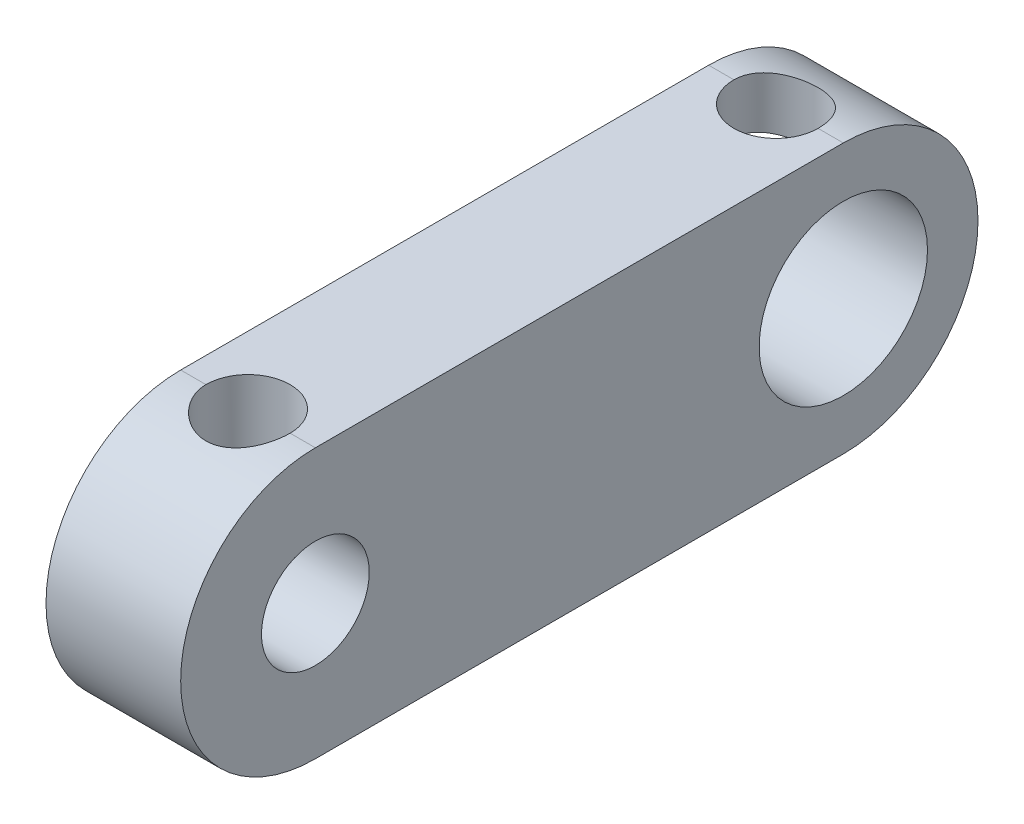
ISO-10303-21;
HEADER;
FILE_DESCRIPTION(('STEP AP214'),'2;1');
FILE_NAME('part.step','',(''),(''),'','','');
FILE_SCHEMA(('AUTOMOTIVE_DESIGN { 1 0 10303 214 1 1 1 1 }'));
ENDSEC;
DATA;
#1=APPLICATION_CONTEXT('core data for automotive mechanical design processes');
#2=APPLICATION_PROTOCOL_DEFINITION('international standard','automotive_design',2000,#1);
#3=PRODUCT_CONTEXT('',#1,'mechanical');
#4=PRODUCT('Part','Part','',(#3));
#5=PRODUCT_RELATED_PRODUCT_CATEGORY('part','',(#4));
#6=PRODUCT_DEFINITION_FORMATION('','',#4);
#7=PRODUCT_DEFINITION_CONTEXT('part definition',#1,'design');
#8=PRODUCT_DEFINITION('design','',#6,#7);
#9=PRODUCT_DEFINITION_SHAPE('','',#8);
#10=(LENGTH_UNIT() NAMED_UNIT(*) SI_UNIT(.MILLI.,.METRE.));
#11=(NAMED_UNIT(*) PLANE_ANGLE_UNIT() SI_UNIT($,.RADIAN.));
#12=(NAMED_UNIT(*) SI_UNIT($,.STERADIAN.) SOLID_ANGLE_UNIT());
#13=UNCERTAINTY_MEASURE_WITH_UNIT(LENGTH_MEASURE(1.E-05),#10,'distance_accuracy_value','');
#14=(GEOMETRIC_REPRESENTATION_CONTEXT(3) GLOBAL_UNCERTAINTY_ASSIGNED_CONTEXT((#13)) GLOBAL_UNIT_ASSIGNED_CONTEXT((#10,
#11,#12)) REPRESENTATION_CONTEXT('',''));
#15=CARTESIAN_POINT('',(0.,0.,0.));
#16=DIRECTION('',(0.,0.,1.));
#17=DIRECTION('',(1.,0.,0.));
#18=AXIS2_PLACEMENT_3D('',#15,#16,#17);
#19=CARTESIAN_POINT('',(2.,0.,0.));
#20=DIRECTION('',(1.,0.,0.));
#21=DIRECTION('',(0.,0.,-1.));
#22=AXIS2_PLACEMENT_3D('',#19,#20,#21);
#23=PLANE('',#22);
#24=CARTESIAN_POINT('',(2.,0.,0.));
#25=DIRECTION('',(1.,0.,0.));
#26=DIRECTION('',(0.,0.,-1.));
#27=AXIS2_PLACEMENT_3D('',#24,#25,#26);
#28=CIRCLE('',#27,1.6);
#29=CARTESIAN_POINT('',(2.,0.,-1.6));
#30=VERTEX_POINT('',#29);
#31=EDGE_CURVE('E229',#30,#30,#28,.T.);
#32=ORIENTED_EDGE('',*,*,#31,.F.);
#33=EDGE_LOOP('',(#32));
#34=FACE_BOUND('',#33,.T.);
#35=CARTESIAN_POINT('',(2.,0.,0.));
#36=DIRECTION('',(1.,0.,0.));
#37=DIRECTION('',(0.,0.,-1.));
#38=AXIS2_PLACEMENT_3D('',#35,#36,#37);
#39=CIRCLE('',#38,4.);
#40=CARTESIAN_POINT('',(2.,4.,0.));
#41=VERTEX_POINT('',#40);
#42=CARTESIAN_POINT('',(2.,-4.,0.));
#43=VERTEX_POINT('',#42);
#44=EDGE_CURVE('E242',#41,#43,#39,.T.);
#45=ORIENTED_EDGE('',*,*,#44,.T.);
#46=DIRECTION('',(0.,0.,-1.));
#47=VECTOR('',#46,1.);
#48=CARTESIAN_POINT('',(2.,-4.,0.));
#49=LINE('',#48,#47);
#50=CARTESIAN_POINT('',(2.,-4.,-15.68));
#51=VERTEX_POINT('',#50);
#52=EDGE_CURVE('E245',#43,#51,#49,.T.);
#53=ORIENTED_EDGE('',*,*,#52,.T.);
#54=CARTESIAN_POINT('',(2.,0.,-15.68));
#55=DIRECTION('',(1.,0.,0.));
#56=DIRECTION('',(0.,0.,-1.));
#57=AXIS2_PLACEMENT_3D('',#54,#55,#56);
#58=CIRCLE('',#57,4.);
#59=CARTESIAN_POINT('',(2.,4.,-15.68));
#60=VERTEX_POINT('',#59);
#61=EDGE_CURVE('E248',#51,#60,#58,.T.);
#62=ORIENTED_EDGE('',*,*,#61,.T.);
#63=DIRECTION('',(0.,0.,1.));
#64=VECTOR('',#63,1.);
#65=CARTESIAN_POINT('',(2.,4.,0.));
#66=LINE('',#65,#64);
#67=EDGE_CURVE('E250',#60,#41,#66,.T.);
#68=ORIENTED_EDGE('',*,*,#67,.T.);
#69=EDGE_LOOP('',(#45,#53,#62,#68));
#70=FACE_BOUND('',#69,.T.);
#71=CARTESIAN_POINT('',(2.,0.,-15.68));
#72=DIRECTION('',(1.,0.,0.));
#73=DIRECTION('',(0.,0.,-1.));
#74=AXIS2_PLACEMENT_3D('',#71,#72,#73);
#75=CIRCLE('',#74,2.5);
#76=CARTESIAN_POINT('',(2.,0.,-18.18));
#77=VERTEX_POINT('',#76);
#78=EDGE_CURVE('E234',#77,#77,#75,.T.);
#79=ORIENTED_EDGE('',*,*,#78,.F.);
#80=EDGE_LOOP('',(#79));
#81=FACE_BOUND('',#80,.T.);
#82=ADVANCED_FACE('F38',(#34,#70,#81),#23,.T.);
#83=CARTESIAN_POINT('',(-2.,0.,0.));
#84=DIRECTION('',(1.,0.,0.));
#85=DIRECTION('',(0.,0.,-1.));
#86=AXIS2_PLACEMENT_3D('',#83,#84,#85);
#87=PLANE('',#86);
#88=CARTESIAN_POINT('',(-2.,0.,0.));
#89=DIRECTION('',(1.,0.,0.));
#90=DIRECTION('',(0.,0.,-1.));
#91=AXIS2_PLACEMENT_3D('',#88,#89,#90);
#92=CIRCLE('',#91,4.);
#93=CARTESIAN_POINT('',(-2.,4.,0.));
#94=VERTEX_POINT('',#93);
#95=CARTESIAN_POINT('',(-2.,-4.,0.));
#96=VERTEX_POINT('',#95);
#97=EDGE_CURVE('E236',#94,#96,#92,.T.);
#98=ORIENTED_EDGE('',*,*,#97,.F.);
#99=DIRECTION('',(0.,0.,1.));
#100=VECTOR('',#99,1.);
#101=CARTESIAN_POINT('',(-2.,4.,0.));
#102=LINE('',#101,#100);
#103=CARTESIAN_POINT('',(-2.,4.,-15.68));
#104=VERTEX_POINT('',#103);
#105=EDGE_CURVE('E246',#104,#94,#102,.T.);
#106=ORIENTED_EDGE('',*,*,#105,.F.);
#107=CARTESIAN_POINT('',(-2.,0.,-15.68));
#108=DIRECTION('',(1.,0.,0.));
#109=DIRECTION('',(0.,0.,-1.));
#110=AXIS2_PLACEMENT_3D('',#107,#108,#109);
#111=CIRCLE('',#110,4.);
#112=CARTESIAN_POINT('',(-2.,-4.,-15.68));
#113=VERTEX_POINT('',#112);
#114=EDGE_CURVE('E127',#113,#104,#111,.T.);
#115=ORIENTED_EDGE('',*,*,#114,.F.);
#116=DIRECTION('',(0.,0.,-1.));
#117=VECTOR('',#116,1.);
#118=CARTESIAN_POINT('',(-2.,-4.,0.));
#119=LINE('',#118,#117);
#120=EDGE_CURVE('E254',#96,#113,#119,.T.);
#121=ORIENTED_EDGE('',*,*,#120,.F.);
#122=EDGE_LOOP('',(#98,#106,#115,#121));
#123=FACE_BOUND('',#122,.T.);
#124=CARTESIAN_POINT('',(-2.,0.,0.));
#125=DIRECTION('',(1.,0.,0.));
#126=DIRECTION('',(0.,0.,-1.));
#127=AXIS2_PLACEMENT_3D('',#124,#125,#126);
#128=CIRCLE('',#127,1.6);
#129=CARTESIAN_POINT('',(-2.,0.,-1.6));
#130=VERTEX_POINT('',#129);
#131=EDGE_CURVE('E232',#130,#130,#128,.T.);
#132=ORIENTED_EDGE('',*,*,#131,.T.);
#133=EDGE_LOOP('',(#132));
#134=FACE_BOUND('',#133,.T.);
#135=CARTESIAN_POINT('',(-2.,0.,-15.68));
#136=DIRECTION('',(1.,0.,0.));
#137=DIRECTION('',(0.,0.,-1.));
#138=AXIS2_PLACEMENT_3D('',#135,#136,#137);
#139=CIRCLE('',#138,2.5);
#140=CARTESIAN_POINT('',(-2.,0.,-18.18));
#141=VERTEX_POINT('',#140);
#142=EDGE_CURVE('E213',#141,#141,#139,.T.);
#143=ORIENTED_EDGE('',*,*,#142,.T.);
#144=EDGE_LOOP('',(#143));
#145=FACE_BOUND('',#144,.T.);
#146=ADVANCED_FACE('F177',(#123,#134,#145),#87,.F.);
#147=CARTESIAN_POINT('',(2.,0.,0.));
#148=DIRECTION('',(-1.,0.,0.));
#149=DIRECTION('',(0.,0.,1.));
#150=AXIS2_PLACEMENT_3D('',#147,#148,#149);
#151=CYLINDRICAL_SURFACE('',#150,4.);
#152=DIRECTION('',(-1.,0.,0.));
#153=VECTOR('',#152,1.);
#154=CARTESIAN_POINT('',(2.,4.,0.));
#155=LINE('',#154,#153);
#156=CARTESIAN_POINT('',(1.25,4.,0.));
#157=VERTEX_POINT('',#156);
#158=EDGE_CURVE('E129',#41,#157,#155,.T.);
#159=ORIENTED_EDGE('',*,*,#158,.T.);
#160=CARTESIAN_POINT('',(1.25,4.,0.));
#161=CARTESIAN_POINT('',(1.25000068192499,4.00000239382464,0.0342840832884206));
#162=CARTESIAN_POINT('',(1.24858860908133,3.99955869763625,0.0685509783801256));
#163=CARTESIAN_POINT('',(1.24296130286244,3.9978046781995,0.136824375647934));
#164=CARTESIAN_POINT('',(1.23874665761304,3.99649453677683,0.170830930942722));
#165=CARTESIAN_POINT('',(1.2219693556147,3.99131416663133,0.271914618020071));
#166=CARTESIAN_POINT('',(1.20527297582088,3.98619364507056,0.33829035451183));
#167=CARTESIAN_POINT('',(1.16143304559352,3.97315917968117,0.467130407420714));
#168=CARTESIAN_POINT('',(1.13429248474057,3.96524603527681,0.529595837194757));
#169=CARTESIAN_POINT('',(1.07039296819695,3.94744238052684,0.6491161948871));
#170=CARTESIAN_POINT('',(1.03362985816415,3.93755101656091,0.706168771384526));
#171=CARTESIAN_POINT('',(0.950345055834868,3.91650242325584,0.814964717697418));
#172=CARTESIAN_POINT('',(0.903581542699087,3.90531774539476,0.86651755791079));
#173=CARTESIAN_POINT('',(0.802134475826564,3.88310103758903,0.961194909805261));
#174=CARTESIAN_POINT('',(0.747449039771977,3.87206904460806,1.00431741262716));
#175=CARTESIAN_POINT('',(0.630054085351311,3.85111120735624,1.0819443164627));
#176=CARTESIAN_POINT('',(0.567179669932036,3.84121943571492,1.11620940995108));
#177=CARTESIAN_POINT('',(0.436204600363461,3.82407768823164,1.17359844406015));
#178=CARTESIAN_POINT('',(0.368105565983853,3.81682689759064,1.19672582161476));
#179=CARTESIAN_POINT('',(0.230772645750465,3.80607612660365,1.23048442546022));
#180=CARTESIAN_POINT('',(0.161634633972238,3.80246980562102,1.24147086756598));
#181=CARTESIAN_POINT('',(0.0224083780122229,3.79910054711683,1.25174556328349));
#182=CARTESIAN_POINT('',(-0.0476796295657095,3.79933666956116,1.25103667809654));
#183=CARTESIAN_POINT('',(-0.183874843206954,3.80353190243403,1.23821821284855));
#184=CARTESIAN_POINT('',(-0.250029884057162,3.80734346144293,1.2265604489678));
#185=CARTESIAN_POINT('',(-0.37939288112431,3.8180203348786,1.19290787753143));
#186=CARTESIAN_POINT('',(-0.442600557163965,3.82488593897253,1.17091208943353));
#187=CARTESIAN_POINT('',(-0.565352271495894,3.84101048347367,1.11688861830883));
#188=CARTESIAN_POINT('',(-0.62482923955642,3.85030294600315,1.08471897460912));
#189=CARTESIAN_POINT('',(-0.737688342405162,3.87021867886758,1.01135970711791));
#190=CARTESIAN_POINT('',(-0.791068953585629,3.880842280497,0.970167835954794));
#191=CARTESIAN_POINT('',(-0.892770211080585,3.90281426048342,0.877721477222062));
#192=CARTESIAN_POINT('',(-0.940750784390827,3.9141736388921,0.826094842820519));
#193=CARTESIAN_POINT('',(-1.02746489236453,3.93591380959217,0.715374277659185));
#194=CARTESIAN_POINT('',(-1.06619606247265,3.94629435124016,0.656278443334608));
#195=CARTESIAN_POINT('',(-1.1335472595053,3.9650184705468,0.53163135295125));
#196=CARTESIAN_POINT('',(-1.1620807803122,3.97334444366063,0.466030631055328));
#197=CARTESIAN_POINT('',(-1.20757374010641,3.98688561436819,0.330673515951714));
#198=CARTESIAN_POINT('',(-1.224550148124,3.99210537131967,0.260923379691176));
#199=CARTESIAN_POINT('',(-1.24028768799857,3.9969734780382,0.158762487295506));
#200=CARTESIAN_POINT('',(-1.2439292395979,3.99810617842266,0.12710678656438));
#201=CARTESIAN_POINT('',(-1.24878331442093,3.99961949031086,0.0636394591712259));
#202=CARTESIAN_POINT('',(-1.24999945623555,4.0000012222107,0.0318281358861974));
#203=CARTESIAN_POINT('',(-1.25000000000006,4.00000000000002,0.));
#204=B_SPLINE_CURVE_WITH_KNOTS('',3,(#160,#161,#162,#163,#164,#165,#166,#167,#168,#169,#170,
#171,#172,#173,#174,#175,#176,#177,#178,#179,#180,#181,#182,#183,#184,#185,#186,#187,#188,#189,
#190,#191,#192,#193,#194,#195,#196,#197,#198,#199,#200,#201,#202,#203),.UNSPECIFIED.,.F.,.F.,(4,
2,2,2,2,2,2,2,2,2,2,2,2,2,2,2,2,2,2,2,2,4),(0.,0.1027866050058,0.205551646826173,
0.41038725930662,0.61516428245364,0.820029860206356,1.03056268318612,1.24114561289923,
1.45693252314487,1.67265280201451,1.88187921475035,2.09105444208602,2.29196026075575,
2.49288513881398,2.69674744968244,2.90066059904601,3.11383808580479,3.32707001193006,
3.54207008631697,3.75675379646107,3.85232219757209,3.9477479083916),.UNSPECIFIED.);
#205=CARTESIAN_POINT('',(-1.25,4.,0.));
#206=VERTEX_POINT('',#205);
#207=EDGE_CURVE('E211',#157,#206,#204,.T.);
#208=ORIENTED_EDGE('',*,*,#207,.T.);
#209=EDGE_CURVE('E133',#206,#94,#155,.T.);
#210=ORIENTED_EDGE('',*,*,#209,.T.);
#211=ORIENTED_EDGE('',*,*,#97,.T.);
#212=DIRECTION('',(-1.,0.,0.));
#213=VECTOR('',#212,1.);
#214=CARTESIAN_POINT('',(2.,-4.,0.));
#215=LINE('',#214,#213);
#216=EDGE_CURVE('E138',#43,#96,#215,.T.);
#217=ORIENTED_EDGE('',*,*,#216,.F.);
#218=ORIENTED_EDGE('',*,*,#44,.F.);
#219=EDGE_LOOP('',(#159,#208,#210,#211,#217,#218));
#220=FACE_BOUND('',#219,.T.);
#221=ADVANCED_FACE('F40',(#220),#151,.T.);
#222=CARTESIAN_POINT('',(2.,-4.,0.));
#223=DIRECTION('',(0.,1.,0.));
#224=DIRECTION('',(0.,0.,1.));
#225=AXIS2_PLACEMENT_3D('',#222,#223,#224);
#226=PLANE('',#225);
#227=ORIENTED_EDGE('',*,*,#120,.T.);
#228=DIRECTION('',(-1.,0.,0.));
#229=VECTOR('',#228,1.);
#230=CARTESIAN_POINT('',(2.,-4.,-15.68));
#231=LINE('',#230,#229);
#232=EDGE_CURVE('E131',#51,#113,#231,.T.);
#233=ORIENTED_EDGE('',*,*,#232,.F.);
#234=ORIENTED_EDGE('',*,*,#52,.F.);
#235=ORIENTED_EDGE('',*,*,#216,.T.);
#236=EDGE_LOOP('',(#227,#233,#234,#235));
#237=FACE_BOUND('',#236,.T.);
#238=ADVANCED_FACE('F191',(#237),#226,.F.);
#239=CARTESIAN_POINT('',(2.,0.,-15.68));
#240=DIRECTION('',(-1.,0.,0.));
#241=DIRECTION('',(0.,0.,1.));
#242=AXIS2_PLACEMENT_3D('',#239,#240,#241);
#243=CYLINDRICAL_SURFACE('',#242,4.);
#244=DIRECTION('',(-1.,0.,0.));
#245=VECTOR('',#244,1.);
#246=CARTESIAN_POINT('',(2.,4.,-15.68));
#247=LINE('',#246,#245);
#248=CARTESIAN_POINT('',(-1.25,4.,-15.68));
#249=VERTEX_POINT('',#248);
#250=EDGE_CURVE('E119',#249,#104,#247,.T.);
#251=ORIENTED_EDGE('',*,*,#250,.F.);
#252=CARTESIAN_POINT('',(-1.25,4.,-15.68));
#253=CARTESIAN_POINT('',(-1.25000068192499,4.00000239382464,-15.7142840832884));
#254=CARTESIAN_POINT('',(-1.24858860908133,3.99955869763625,-15.7485509783801));
#255=CARTESIAN_POINT('',(-1.24296130286244,3.9978046781995,-15.8168243756479));
#256=CARTESIAN_POINT('',(-1.23874665761304,3.99649453677683,-15.8508309309427));
#257=CARTESIAN_POINT('',(-1.2219693556147,3.99131416663133,-15.9519146180201));
#258=CARTESIAN_POINT('',(-1.20527297582088,3.98619364507057,-16.0182903545118));
#259=CARTESIAN_POINT('',(-1.16143304559352,3.97315917968117,-16.1471304074207));
#260=CARTESIAN_POINT('',(-1.13429248474057,3.96524603527681,-16.2095958371948));
#261=CARTESIAN_POINT('',(-1.07039296819695,3.94744238052685,-16.3291161948871));
#262=CARTESIAN_POINT('',(-1.03362985816415,3.93755101656092,-16.3861687713845));
#263=CARTESIAN_POINT('',(-0.950345055834869,3.91650242325585,-16.4949647176974));
#264=CARTESIAN_POINT('',(-0.903581542699088,3.90531774539477,-16.5465175579108));
#265=CARTESIAN_POINT('',(-0.802134475826566,3.88310103758903,-16.6411949098053));
#266=CARTESIAN_POINT('',(-0.747449039771979,3.87206904460807,-16.6843174126272));
#267=CARTESIAN_POINT('',(-0.630054085351312,3.85111120735624,-16.7619443164627));
#268=CARTESIAN_POINT('',(-0.567179669932038,3.84121943571493,-16.7962094099511));
#269=CARTESIAN_POINT('',(-0.436204600363463,3.82407768823165,-16.8535984440602));
#270=CARTESIAN_POINT('',(-0.368105565983854,3.81682689759065,-16.8767258216148));
#271=CARTESIAN_POINT('',(-0.230772645750467,3.80607612660366,-16.9104844254602));
#272=CARTESIAN_POINT('',(-0.16163463397224,3.80246980562103,-16.921470867566));
#273=CARTESIAN_POINT('',(-0.0224083780122244,3.79910054711684,-16.9317455632835));
#274=CARTESIAN_POINT('',(0.047679629565708,3.79933666956117,-16.9310366780965));
#275=CARTESIAN_POINT('',(0.183874843206953,3.80353190243404,-16.9182182128485));
#276=CARTESIAN_POINT('',(0.250029884057162,3.80734346144294,-16.9065604489678));
#277=CARTESIAN_POINT('',(0.37939288112431,3.81802033487861,-16.8729078775314));
#278=CARTESIAN_POINT('',(0.442600557163965,3.82488593897254,-16.8509120894335));
#279=CARTESIAN_POINT('',(0.565352271495894,3.84101048347368,-16.7968886183088));
#280=CARTESIAN_POINT('',(0.624829239556421,3.85030294600316,-16.7647189746091));
#281=CARTESIAN_POINT('',(0.737688342405162,3.87021867886759,-16.6913597071179));
#282=CARTESIAN_POINT('',(0.791068953585628,3.880842280497,-16.6501678359548));
#283=CARTESIAN_POINT('',(0.892770211080585,3.90281426048343,-16.5577214772221));
#284=CARTESIAN_POINT('',(0.940750784390828,3.91417363889211,-16.5060948428205));
#285=CARTESIAN_POINT('',(1.02746489236453,3.93591380959217,-16.3953742776592));
#286=CARTESIAN_POINT('',(1.06619606247265,3.94629435124016,-16.3362784433346));
#287=CARTESIAN_POINT('',(1.1335472595053,3.96501847054681,-16.2116313529512));
#288=CARTESIAN_POINT('',(1.1620807803122,3.97334444366063,-16.1460306310553));
#289=CARTESIAN_POINT('',(1.20757374010641,3.98688561436819,-16.0106735159517));
#290=CARTESIAN_POINT('',(1.224550148124,3.99210537131967,-15.9409233796912));
#291=CARTESIAN_POINT('',(1.24028768799857,3.9969734780382,-15.8387624872955));
#292=CARTESIAN_POINT('',(1.2439292395979,3.99810617842266,-15.8071067865644));
#293=CARTESIAN_POINT('',(1.24878331442093,3.99961949031086,-15.7436394591712));
#294=CARTESIAN_POINT('',(1.24999945623555,4.0000012222107,-15.7118281358862));
#295=CARTESIAN_POINT('',(1.25000000000006,4.00000000000002,-15.68));
#296=B_SPLINE_CURVE_WITH_KNOTS('',3,(#252,#253,#254,#255,#256,#257,#258,#259,#260,#261,#262,
#263,#264,#265,#266,#267,#268,#269,#270,#271,#272,#273,#274,#275,#276,#277,#278,#279,#280,#281,
#282,#283,#284,#285,#286,#287,#288,#289,#290,#291,#292,#293,#294,#295),.UNSPECIFIED.,.F.,.F.,(4,
2,2,2,2,2,2,2,2,2,2,2,2,2,2,2,2,2,2,2,2,4),(0.,0.102786605005803,0.205551646826173,
0.41038725930662,0.615164282453638,0.820029860206353,1.03056268318612,1.24114561289923,
1.45693252314487,1.67265280201451,1.88187921475034,2.09105444208602,2.29196026075575,
2.49288513881398,2.69674744968243,2.90066059904601,3.11383808580479,3.32707001193007,
3.54207008631698,3.75675379646106,3.85232219757209,3.9477479083916),.UNSPECIFIED.);
#297=CARTESIAN_POINT('',(1.25,4.,-15.68));
#298=VERTEX_POINT('',#297);
#299=EDGE_CURVE('E109',#249,#298,#296,.T.);
#300=ORIENTED_EDGE('',*,*,#299,.T.);
#301=EDGE_CURVE('E122',#60,#298,#247,.T.);
#302=ORIENTED_EDGE('',*,*,#301,.F.);
#303=ORIENTED_EDGE('',*,*,#61,.F.);
#304=ORIENTED_EDGE('',*,*,#232,.T.);
#305=ORIENTED_EDGE('',*,*,#114,.T.);
#306=EDGE_LOOP('',(#251,#300,#302,#303,#304,#305));
#307=FACE_BOUND('',#306,.T.);
#308=ADVANCED_FACE('F124',(#307),#243,.T.);
#309=CARTESIAN_POINT('',(2.,4.,0.));
#310=DIRECTION('',(0.,-1.,0.));
#311=DIRECTION('',(0.,0.,-1.));
#312=AXIS2_PLACEMENT_3D('',#309,#310,#311);
#313=PLANE('',#312);
#314=ORIENTED_EDGE('',*,*,#301,.T.);
#315=CARTESIAN_POINT('',(0.,4.,-15.68));
#316=DIRECTION('',(0.,1.,0.));
#317=DIRECTION('',(0.,0.,1.));
#318=AXIS2_PLACEMENT_3D('',#315,#316,#317);
#319=CIRCLE('',#318,1.25);
#320=EDGE_CURVE('E59',#249,#298,#319,.T.);
#321=ORIENTED_EDGE('',*,*,#320,.F.);
#322=ORIENTED_EDGE('',*,*,#250,.T.);
#323=ORIENTED_EDGE('',*,*,#105,.T.);
#324=ORIENTED_EDGE('',*,*,#209,.F.);
#325=CARTESIAN_POINT('',(0.,4.,0.));
#326=DIRECTION('',(0.,1.,0.));
#327=DIRECTION('',(0.,0.,1.));
#328=AXIS2_PLACEMENT_3D('',#325,#326,#327);
#329=CIRCLE('',#328,1.25);
#330=EDGE_CURVE('E66',#157,#206,#329,.T.);
#331=ORIENTED_EDGE('',*,*,#330,.F.);
#332=ORIENTED_EDGE('',*,*,#158,.F.);
#333=ORIENTED_EDGE('',*,*,#67,.F.);
#334=EDGE_LOOP('',(#314,#321,#322,#323,#324,#331,#332,#333));
#335=FACE_BOUND('',#334,.T.);
#336=ADVANCED_FACE('F117',(#335),#313,.F.);
#337=CARTESIAN_POINT('',(2.,0.,0.));
#338=DIRECTION('',(-1.,0.,0.));
#339=DIRECTION('',(0.,0.,1.));
#340=AXIS2_PLACEMENT_3D('',#337,#338,#339);
#341=CYLINDRICAL_SURFACE('',#340,1.6);
#342=CARTESIAN_POINT('',(0.,0.99874921777191,1.25));
#343=CARTESIAN_POINT('',(-0.0572273514212238,0.998751265939994,1.24999905834348));
#344=CARTESIAN_POINT('',(-0.114458665652514,1.00378953333034,1.24602069122532));
#345=CARTESIAN_POINT('',(-0.226534764196548,1.02260534363583,1.23061486703401));
#346=CARTESIAN_POINT('',(-0.281368397094433,1.03641986154477,1.21915588792608));
#347=CARTESIAN_POINT('',(-0.399054122237964,1.07375577013903,1.18649982329253));
#348=CARTESIAN_POINT('',(-0.46096647802075,1.0987550336182,1.16370069342189));
#349=CARTESIAN_POINT('',(-0.578859739565842,1.15318602938461,1.10979033563246));
#350=CARTESIAN_POINT('',(-0.634833665059069,1.18262288156126,1.07866947395733));
#351=CARTESIAN_POINT('',(-0.742435836330529,1.24366445025344,1.00774651870663));
#352=CARTESIAN_POINT('',(-0.793897128795358,1.27530688389674,0.967724462255409));
#353=CARTESIAN_POINT('',(-0.890324655930659,1.33746999390147,0.879813626144227));
#354=CARTESIAN_POINT('',(-0.935295712968591,1.36799149043748,0.831930744363974));
#355=CARTESIAN_POINT('',(-1.01607322619894,1.42446952840122,0.730813168250992));
#356=CARTESIAN_POINT('',(-1.05220295459148,1.45057037092651,0.677919934131213));
#357=CARTESIAN_POINT('',(-1.11660878838174,1.49794525134417,0.565565347858338));
#358=CARTESIAN_POINT('',(-1.144892395113,1.51922389593992,0.506110345691673));
#359=CARTESIAN_POINT('',(-1.18851456156367,1.55238511734723,0.391283979059254));
#360=CARTESIAN_POINT('',(-1.20517477777216,1.56520930111297,0.336690060257667));
#361=CARTESIAN_POINT('',(-1.23096771265543,1.58515420726718,0.224745398736868));
#362=CARTESIAN_POINT('',(-1.24010533977355,1.5922786486169,0.167396479537486));
#363=CARTESIAN_POINT('',(-1.25030501285175,1.6002350511513,0.051364347022362));
#364=CARTESIAN_POINT('',(-1.25134260258556,1.6010479560426,-0.00732237094912021));
#365=CARTESIAN_POINT('',(-1.24520591505884,1.59625629926918,-0.123999749464817));
#366=CARTESIAN_POINT('',(-1.23803055958411,1.59065089499414,-0.181990317606841));
#367=CARTESIAN_POINT('',(-1.21644648362201,1.57391185245859,-0.29292971219426));
#368=CARTESIAN_POINT('',(-1.20238396125841,1.56304305723946,-0.34598781189416));
#369=CARTESIAN_POINT('',(-1.16792340055555,1.53669192975132,-0.448771907757385));
#370=CARTESIAN_POINT('',(-1.14752386301698,1.52120850579721,-0.498497112042553));
#371=CARTESIAN_POINT('',(-1.09879028257806,1.48477294693279,-0.598819194787112));
#372=CARTESIAN_POINT('',(-1.06985443577636,1.46342120718756,-0.648975882123226));
#373=CARTESIAN_POINT('',(-1.00619811295245,1.41754984183172,-0.743865035342757));
#374=CARTESIAN_POINT('',(-0.971473671010785,1.39302804693647,-0.788593745820148));
#375=CARTESIAN_POINT('',(-0.889350046017756,1.33692277094439,-0.880977367359064));
#376=CARTESIAN_POINT('',(-0.840810753631283,1.30492007930093,-0.927363248135251));
#377=CARTESIAN_POINT('',(-0.737053708439757,1.24059681170246,-1.01179733080002));
#378=CARTESIAN_POINT('',(-0.681829853846242,1.20827597043251,-1.04983782443949));
#379=CARTESIAN_POINT('',(-0.573705687518589,1.15102759763119,-1.11204428863955));
#380=CARTESIAN_POINT('',(-0.521714697780788,1.12572079183531,-1.13743811986655));
#381=CARTESIAN_POINT('',(-0.412995054401273,1.0796549739323,-1.18125067713538));
#382=CARTESIAN_POINT('',(-0.356277283546026,1.05888589322772,-1.19968491317817));
#383=CARTESIAN_POINT('',(-0.253565913830679,1.02958144912797,-1.22484238609105));
#384=CARTESIAN_POINT('',(-0.208529554987659,1.01927665296451,-1.2333537264903));
#385=CARTESIAN_POINT('',(-0.116879836113802,1.00455417669427,-1.24537755335448));
#386=CARTESIAN_POINT('',(-0.0702695590342942,1.00012560258356,-1.24889929093254));
#387=CARTESIAN_POINT('',(0.0233772214685586,0.997923166875079,-1.25066089515464));
#388=CARTESIAN_POINT('',(0.0704146350579515,1.0001719709581,-1.24888277188252));
#389=CARTESIAN_POINT('',(0.163294365563975,1.01095205836642,-1.24016928182665));
#390=CARTESIAN_POINT('',(0.209134760876139,1.01949286889583,-1.233226094071));
#391=CARTESIAN_POINT('',(0.312474181646216,1.04494170122144,-1.2117947282627));
#392=CARTESIAN_POINT('',(0.369175527410544,1.06362399225664,-1.19563357154923));
#393=CARTESIAN_POINT('',(0.478114952713838,1.10614582421928,-1.15640786986471));
#394=CARTESIAN_POINT('',(0.530338807492897,1.13000100938247,-1.13332230059851));
#395=CARTESIAN_POINT('',(0.649112343517193,1.18966109000859,-1.07107111086496));
#396=CARTESIAN_POINT('',(0.713643833983155,1.22658135514995,-1.02912425520167));
#397=CARTESIAN_POINT('',(0.834018826435058,1.30032578495316,-0.934224999528154));
#398=CARTESIAN_POINT('',(0.889865384451285,1.33714997891527,-0.881276486141612));
#399=CARTESIAN_POINT('',(0.983632340409942,1.40145436448698,-0.774067914503405));
#400=CARTESIAN_POINT('',(1.02299121054839,1.42948318277441,-0.721400483964689));
#401=CARTESIAN_POINT('',(1.09367445299914,1.48089025242947,-0.608910199021777));
#402=CARTESIAN_POINT('',(1.12501194504017,1.50427608360296,-0.549099266603676));
#403=CARTESIAN_POINT('',(1.17363795347102,1.54101238030314,-0.433927596744466));
#404=CARTESIAN_POINT('',(1.19240568683844,1.55539088153163,-0.379522900511656));
#405=CARTESIAN_POINT('',(1.22241154588911,1.57851120189539,-0.267514764653618));
#406=CARTESIAN_POINT('',(1.23365387575963,1.58725616819235,-0.209913130560985));
#407=CARTESIAN_POINT('',(1.24794490288963,1.59838858537562,-0.0928533442405135));
#408=CARTESIAN_POINT('',(1.25096214900656,1.60075163270931,-0.0333889428129077));
#409=CARTESIAN_POINT('',(1.24849979741205,1.59882803056043,0.0852539448371107));
#410=CARTESIAN_POINT('',(1.24302030477152,1.59454146330717,0.144432434586037));
#411=CARTESIAN_POINT('',(1.22453406409658,1.58017495024284,0.257049617293854));
#412=CARTESIAN_POINT('',(1.2120099237008,1.57046670595894,0.31061767478617));
#413=CARTESIAN_POINT('',(1.18047528374457,1.54626001737922,0.414650919220575));
#414=CARTESIAN_POINT('',(1.16146324237869,1.5317604344804,0.4651153652431));
#415=CARTESIAN_POINT('',(1.11584068422015,1.49744927633756,0.566344033276618));
#416=CARTESIAN_POINT('',(1.0887136772977,1.47728574401469,0.616753702720855));
#417=CARTESIAN_POINT('',(1.02867965220248,1.43361695306987,0.712398468161285));
#418=CARTESIAN_POINT('',(0.995769369642052,1.41010980857158,0.757630617751574));
#419=CARTESIAN_POINT('',(0.917897673063162,1.35613203819314,0.851095449447686));
#420=CARTESIAN_POINT('',(0.871840318644933,1.32520414273692,0.898149428645243));
#421=CARTESIAN_POINT('',(0.77324196924658,1.26251603568879,0.984323487543084));
#422=CARTESIAN_POINT('',(0.720694232358756,1.23075498608171,1.02343520380839));
#423=CARTESIAN_POINT('',(0.613783142119041,1.17149750276231,1.09061234236973));
#424=CARTESIAN_POINT('',(0.559893895820892,1.14386258992758,1.11930763069456));
#425=CARTESIAN_POINT('',(0.446739735553832,1.09294568421227,1.16907362083412));
#426=CARTESIAN_POINT('',(0.387481435082102,1.06965844137712,1.19015354760204));
#427=CARTESIAN_POINT('',(0.273995737308639,1.03449292573763,1.22077179261696));
#428=CARTESIAN_POINT('',(0.220532093345643,1.02137122628821,1.23163436131941));
#429=CARTESIAN_POINT('',(0.111374011532058,1.00351430854028,1.24623538659025));
#430=CARTESIAN_POINT('',(0.0556888820690091,0.998747224665676,1.25000091634153));
#431=CARTESIAN_POINT('',(0.,0.99874921777191,1.25));
#432=B_SPLINE_CURVE_WITH_KNOTS('',3,(#342,#343,#344,#345,#346,#347,#348,#349,#350,#351,#352,
#353,#354,#355,#356,#357,#358,#359,#360,#361,#362,#363,#364,#365,#366,#367,#368,#369,#370,#371,
#372,#373,#374,#375,#376,#377,#378,#379,#380,#381,#382,#383,#384,#385,#386,#387,#388,#389,#390,
#391,#392,#393,#394,#395,#396,#397,#398,#399,#400,#401,#402,#403,#404,#405,#406,#407,#408,#409,
#410,#411,#412,#413,#414,#415,#416,#417,#418,#419,#420,#421,#422,#423,#424,#425,#426,#427,#428,
#429,#430,#431),.UNSPECIFIED.,.T.,.F.,(4,2,2,2,2,2,2,2,2,2,2,2,2,2,2,2,2,2,2,2,2,2,2,2,2,2,2,2,
2,2,2,2,2,2,2,2,2,2,2,2,2,2,2,2,4),(0.,0.171385463584771,0.343497819134045,0.554002024871388,
0.764750986433634,0.981440047044859,1.19796726540001,1.40466875512033,1.61117194012664,
1.78592752284094,1.96056898802947,2.13573754035982,2.31092909185545,2.47810000769838,
2.64531050268507,2.82978713315135,3.01439067683293,3.23670805376966,3.45922991844449,
3.64813520662838,3.836616984055,3.9769962657643,4.11711493119153,4.25770975827707,
4.39851790934574,4.58303191093621,4.76811191521934,5.02294123801551,5.27768068828015,
5.49128252775354,5.7045327358806,5.88174549683142,6.05885917222085,6.23664915260014,
6.41443693444118,6.58131338817977,6.74822952661851,6.92964112313798,7.11115544884177,
7.32860385459196,7.54628006583599,7.74670135855695,7.9468790481142,8.11429703185955,
8.28107506077206),.UNSPECIFIED.);
#433=CARTESIAN_POINT('',(0.,0.99874921777191,1.25));
#434=VERTEX_POINT('',#433);
#435=EDGE_CURVE('E149',#434,#434,#432,.T.);
#436=ORIENTED_EDGE('',*,*,#435,.F.);
#437=EDGE_LOOP('',(#436));
#438=FACE_BOUND('',#437,.T.);
#439=CARTESIAN_POINT('',(-0.0499999999999743,-1.,1.24899959967968));
#440=CARTESIAN_POINT('',(-0.0333333333333162,-0.999166145181609,1.24966653322656));
#441=CARTESIAN_POINT('',(-0.0166666666666581,-0.998749217772413,1.25));
#442=CARTESIAN_POINT('',(0.0166666666666581,-0.998749217772413,1.25));
#443=CARTESIAN_POINT('',(0.0333333333333162,-0.999166145181609,1.24966653322656));
#444=CARTESIAN_POINT('',(0.0499999999999744,-1.,1.24899959967968));
#445=B_SPLINE_CURVE_WITH_KNOTS('',3,(#439,#440,#441,#442,#443,#444),.UNSPECIFIED.,.F.,.F.,(4,2,
4),(0.,0.0500256459926224,0.100051291985245),.UNSPECIFIED.);
#446=CARTESIAN_POINT('',(-0.0499999999999653,-1.,1.24899959967968));
#447=VERTEX_POINT('',#446);
#448=CARTESIAN_POINT('',(0.0499999999999669,-1.,1.24899959967968));
#449=VERTEX_POINT('',#448);
#450=EDGE_CURVE('E11',#447,#449,#445,.T.);
#451=ORIENTED_EDGE('',*,*,#450,.F.);
#452=ORIENTED_EDGE('',*,*,#450,.T.);
#453=EDGE_LOOP('',(#451,#452));
#454=FACE_BOUND('',#453,.T.);
#455=CARTESIAN_POINT('',(0.0499999999999743,-1.,-1.24899959967968));
#456=CARTESIAN_POINT('',(0.0333333333333162,-0.999166145181609,-1.24966653322656));
#457=CARTESIAN_POINT('',(0.0166666666666581,-0.998749217772413,-1.25));
#458=CARTESIAN_POINT('',(-0.0166666666666581,-0.998749217772413,-1.25));
#459=CARTESIAN_POINT('',(-0.0333333333333162,-0.999166145181609,-1.24966653322656));
#460=CARTESIAN_POINT('',(-0.0499999999999744,-1.,-1.24899959967968));
#461=B_SPLINE_CURVE_WITH_KNOTS('',3,(#455,#456,#457,#458,#459,#460),.UNSPECIFIED.,.F.,.F.,(4,2,
4),(0.,0.0500256459926224,0.100051291985245),.UNSPECIFIED.);
#462=CARTESIAN_POINT('',(0.0499999999999666,-1.,-1.24899959967968));
#463=VERTEX_POINT('',#462);
#464=CARTESIAN_POINT('',(-0.0499999999999656,-1.,-1.24899959967968));
#465=VERTEX_POINT('',#464);
#466=EDGE_CURVE('E53',#463,#465,#461,.T.);
#467=ORIENTED_EDGE('',*,*,#466,.F.);
#468=ORIENTED_EDGE('',*,*,#466,.T.);
#469=EDGE_LOOP('',(#467,#468));
#470=FACE_BOUND('',#469,.T.);
#471=CARTESIAN_POINT('',(-0.179219064461161,-1.58655127889983,-0.207014587460514));
#472=CARTESIAN_POINT('',(-0.190180033738006,-1.58828821683532,-0.193700928801702));
#473=CARTESIAN_POINT('',(-0.199963590126673,-1.58998126222119,-0.179406916043187));
#474=CARTESIAN_POINT('',(-0.217063185612627,-1.59308271371301,-0.14938439428579));
#475=CARTESIAN_POINT('',(-0.224377235566798,-1.59449088999781,-0.133654741797192));
#476=CARTESIAN_POINT('',(-0.236516595060475,-1.59689123303704,-0.10103690815429));
#477=CARTESIAN_POINT('',(-0.24131383991934,-1.59787868643934,-0.0841379468142688));
#478=CARTESIAN_POINT('',(-0.248228947876691,-1.59931771693823,-0.0497842626808421));
#479=CARTESIAN_POINT('',(-0.250347276024462,-1.59976938704383,-0.0323296368880634));
#480=CARTESIAN_POINT('',(-0.251918396458895,-1.60010321529458,0.00375716336211255));
#481=CARTESIAN_POINT('',(-0.251203746036564,-1.59994960136655,0.0223971903117148));
#482=CARTESIAN_POINT('',(-0.246739539288673,-1.59900739834526,0.0592980612441438));
#483=CARTESIAN_POINT('',(-0.242989248317235,-1.59821865554668,0.077558812342291));
#484=CARTESIAN_POINT('',(-0.232490659088049,-1.59608670172297,0.113263860893642));
#485=CARTESIAN_POINT('',(-0.225727796103259,-1.59474079928902,0.130703731201635));
#486=CARTESIAN_POINT('',(-0.209287854522185,-1.59164722833184,0.164137476630918));
#487=CARTESIAN_POINT('',(-0.199608927930374,-1.58989930520292,0.180130426414256));
#488=CARTESIAN_POINT('',(-0.177869730415439,-1.58629299769523,0.209488291806312));
#489=CARTESIAN_POINT('',(-0.165910569908129,-1.58444107395899,0.222928433715514));
#490=CARTESIAN_POINT('',(-0.139571829016075,-1.58083789058209,0.247187591274302));
#491=CARTESIAN_POINT('',(-0.125198592841479,-1.57908638282411,0.258013300445915));
#492=CARTESIAN_POINT('',(-0.0992971061042055,-1.57649384940425,0.273326179977782));
#493=CARTESIAN_POINT('',(-0.0883209755998309,-1.57554051841095,0.27873397345857));
#494=CARTESIAN_POINT('',(-0.0656102176213956,-1.5739319463733,0.287678591199289));
#495=CARTESIAN_POINT('',(-0.0538763641686954,-1.57327640646641,0.291217291860079));
#496=CARTESIAN_POINT('',(-0.0298924215324208,-1.57234504745311,0.296205614716668));
#497=CARTESIAN_POINT('',(-0.0176400973629448,-1.57207109237413,0.297644983354569));
#498=CARTESIAN_POINT('',(0.00692611088887346,-1.57194893068282,0.298289662188846));
#499=CARTESIAN_POINT('',(0.0192399884127845,-1.57210067963839,0.297495205536741));
#500=CARTESIAN_POINT('',(0.0425814410182681,-1.57277980190641,0.293881850758637));
#501=CARTESIAN_POINT('',(0.0536352973588773,-1.57327751392927,0.291222675975107));
#502=CARTESIAN_POINT('',(0.0751740457717834,-1.57455796638529,0.284217841295441));
#503=CARTESIAN_POINT('',(0.0856588055975266,-1.57534077274557,0.279871791299805));
#504=CARTESIAN_POINT('',(0.106493569737766,-1.57716779828903,0.269391163152782));
#505=CARTESIAN_POINT('',(0.116794489781636,-1.57822526457952,0.263162032642778));
#506=CARTESIAN_POINT('',(0.136390977373734,-1.58047277788995,0.249309114337972));
#507=CARTESIAN_POINT('',(0.145686068678661,-1.58166288717748,0.241684670443418));
#508=CARTESIAN_POINT('',(0.164671223206516,-1.5842876946767,0.223888968662284));
#509=CARTESIAN_POINT('',(0.174160820218352,-1.58572963760146,0.213505083110816));
#510=CARTESIAN_POINT('',(0.191568351835257,-1.58853903917314,0.191486729115645));
#511=CARTESIAN_POINT('',(0.199485276693223,-1.5899064495597,0.17985146455508));
#512=CARTESIAN_POINT('',(0.214913832823335,-1.59268194798298,0.153518203869231));
#513=CARTESIAN_POINT('',(0.222121182555321,-1.59405653010701,0.138637742858458));
#514=CARTESIAN_POINT('',(0.234222433326688,-1.59642954868666,0.107935940542093));
#515=CARTESIAN_POINT('',(0.239115307686365,-1.5974278181737,0.0921141851838491));
#516=CARTESIAN_POINT('',(0.246895054770365,-1.59903570118169,0.0582966530365405));
#517=CARTESIAN_POINT('',(0.249534264477405,-1.59959683419597,0.0402410780869775));
#518=CARTESIAN_POINT('',(0.251895865347518,-1.60009826821249,0.00393189663031782));
#519=CARTESIAN_POINT('',(0.251617854487696,-1.60003848364594,-0.0143217368250012));
#520=CARTESIAN_POINT('',(0.248101995823071,-1.59929404663152,-0.0510357139991987));
#521=CARTESIAN_POINT('',(0.244783410375353,-1.59859235002103,-0.0694880587121219));
#522=CARTESIAN_POINT('',(0.235125882042751,-1.59661595166639,-0.105565958788643));
#523=CARTESIAN_POINT('',(0.228785332253529,-1.59534094508987,-0.123191068793515));
#524=CARTESIAN_POINT('',(0.213239897726152,-1.59237528854031,-0.15692538660845));
#525=CARTESIAN_POINT('',(0.20405815190879,-1.59068801862323,-0.173045518018393));
#526=CARTESIAN_POINT('',(0.182928045667978,-1.58710076901469,-0.203329856299725));
#527=CARTESIAN_POINT('',(0.170983329653104,-1.58520107120986,-0.217496600776572));
#528=CARTESIAN_POINT('',(0.1478770408245,-1.58194343331469,-0.239893940805973));
#529=CARTESIAN_POINT('',(0.137290588182953,-1.58057072144784,-0.248717517642159));
#530=CARTESIAN_POINT('',(0.114797952639274,-1.57800176393887,-0.264526922556069));
#531=CARTESIAN_POINT('',(0.102892660176843,-1.5768054004884,-0.271513979974227));
#532=CARTESIAN_POINT('',(0.0778765510376502,-1.57473062589108,-0.283301920977311));
#533=CARTESIAN_POINT('',(0.0647561625998203,-1.57385506632962,-0.288083291098791));
#534=CARTESIAN_POINT('',(0.0378112914935868,-1.57257738111962,-0.294980052607578));
#535=CARTESIAN_POINT('',(0.0239876903560853,-1.57217467725945,-0.29709870021634));
#536=CARTESIAN_POINT('',(-0.00178382039460541,-1.57193231758526,-0.298377008861009));
#537=CARTESIAN_POINT('',(-0.0137132296580138,-1.57201952131582,-0.297920996273817));
#538=CARTESIAN_POINT('',(-0.0373034948608047,-1.57257824013153,-0.294957507669851));
#539=CARTESIAN_POINT('',(-0.048964352719098,-1.57304975246977,-0.292450046316205));
#540=CARTESIAN_POINT('',(-0.0712484658373642,-1.57429141402482,-0.285688017327963));
#541=CARTESIAN_POINT('',(-0.0818944059363975,-1.57504931472355,-0.281504731751704));
#542=CARTESIAN_POINT('',(-0.102430691632677,-1.57678434231346,-0.271617857154958));
#543=CARTESIAN_POINT('',(-0.112320845848691,-1.57776152448645,-0.265913884694394));
#544=CARTESIAN_POINT('',(-0.132576916533095,-1.58000032568907,-0.252295439140869));
#545=CARTESIAN_POINT('',(-0.142805543873521,-1.58128264159514,-0.244180760771014));
#546=CARTESIAN_POINT('',(-0.161987231996535,-1.58390204668947,-0.226569586448931));
#547=CARTESIAN_POINT('',(-0.170939086319421,-1.58523918616641,-0.217071800458495));
#548=CARTESIAN_POINT('',(-0.179219064461161,-1.58655127889983,-0.207014587460514));
#549=B_SPLINE_CURVE_WITH_KNOTS('',3,(#471,#472,#473,#474,#475,#476,#477,#478,#479,#480,#481,
#482,#483,#484,#485,#486,#487,#488,#489,#490,#491,#492,#493,#494,#495,#496,#497,#498,#499,#500,
#501,#502,#503,#504,#505,#506,#507,#508,#509,#510,#511,#512,#513,#514,#515,#516,#517,#518,#519,
#520,#521,#522,#523,#524,#525,#526,#527,#528,#529,#530,#531,#532,#533,#534,#535,#536,#537,#538,
#539,#540,#541,#542,#543,#544,#545,#546,#547,#548),.UNSPECIFIED.,.T.,.F.,(4,2,2,2,2,2,2,2,2,2,2,
2,2,2,2,2,2,2,2,2,2,2,2,2,2,2,2,2,2,2,2,2,2,2,2,2,2,2,4),(0.,0.0519482146944992,
0.103938173473666,0.156496166102696,0.209045033620286,0.264744755748967,0.320457961624864,
0.376443494994717,0.4324645829465,0.48641740906476,0.540230603875596,0.576902637216551,
0.613537784826352,0.650351273470604,0.687160919915477,0.721151125758251,0.755149196717525,
0.791265220311551,0.827398270105147,0.869660637364552,0.911950052438225,0.961518067383454,
1.0111080496663,1.06562599580007,1.12015145516427,1.17616807586732,1.23221451622985,
1.28781601646825,1.34334459134195,1.38473309646525,1.42609382573645,1.46781376425492,
1.5094826340035,1.54511275395256,1.58074261923065,1.61499519382591,1.6492564133646,
1.68846158426513,1.72770355925009),.UNSPECIFIED.);
#550=CARTESIAN_POINT('',(-0.179219064461161,-1.58655127889983,-0.207014587460514));
#551=VERTEX_POINT('',#550);
#552=EDGE_CURVE('E141',#551,#551,#549,.T.);
#553=ORIENTED_EDGE('',*,*,#552,.F.);
#554=EDGE_LOOP('',(#553));
#555=FACE_BOUND('',#554,.T.);
#556=ORIENTED_EDGE('',*,*,#31,.T.);
#557=EDGE_LOOP('',(#556));
#558=FACE_BOUND('',#557,.T.);
#559=ORIENTED_EDGE('',*,*,#131,.F.);
#560=EDGE_LOOP('',(#559));
#561=FACE_BOUND('',#560,.T.);
#562=ADVANCED_FACE('F157',(#438,#454,#470,#555,#558,#561),#341,.F.);
#563=CARTESIAN_POINT('',(2.,0.,-15.68));
#564=DIRECTION('',(-1.,0.,0.));
#565=DIRECTION('',(0.,0.,1.));
#566=AXIS2_PLACEMENT_3D('',#563,#564,#565);
#567=CYLINDRICAL_SURFACE('',#566,2.5);
#568=CARTESIAN_POINT('',(0.,2.16506350946108,-14.43));
#569=CARTESIAN_POINT('',(-0.0651347602440622,2.16506918410572,-14.4300045461568));
#570=CARTESIAN_POINT('',(-0.130351764406306,2.16804751484694,-14.4351250365835));
#571=CARTESIAN_POINT('',(-0.25878408084644,2.17952958065064,-14.4553459876274));
#572=CARTESIAN_POINT('',(-0.321994893804258,2.18804492569448,-14.4704674193073));
#573=CARTESIAN_POINT('',(-0.444314580429924,2.20936683256746,-14.5098750641252));
#574=CARTESIAN_POINT('',(-0.503443315591981,2.22215054341563,-14.5341125593828));
#575=CARTESIAN_POINT('',(-0.616780252495896,2.25053331021071,-14.5909155932795));
#576=CARTESIAN_POINT('',(-0.670988187828068,2.26613251845079,-14.6234815824553));
#577=CARTESIAN_POINT('',(-0.777882160696878,2.299960863218,-14.6991668243364));
#578=CARTESIAN_POINT('',(-0.830073919591925,2.31830079547441,-14.7429349548203));
#579=CARTESIAN_POINT('',(-0.926760485508382,2.35464978482131,-14.8384327404819));
#580=CARTESIAN_POINT('',(-0.971251453229396,2.37265867289061,-14.8901663427721));
#581=CARTESIAN_POINT('',(-1.05420893893457,2.40776846191185,-15.0043880457318));
#582=CARTESIAN_POINT('',(-1.09206720982441,2.42472633022715,-15.0673660137343));
#583=CARTESIAN_POINT('',(-1.1564260665572,2.4543844512441,-15.1998037167506));
#584=CARTESIAN_POINT('',(-1.18293382017146,2.46708738979676,-15.2692593273273));
#585=CARTESIAN_POINT('',(-1.22188082662637,2.48600576555296,-15.4074438200925));
#586=CARTESIAN_POINT('',(-1.23518690794442,2.49261850276115,-15.475872761889));
#587=CARTESIAN_POINT('',(-1.2502076483438,2.50009479807584,-15.6142867141277));
#588=CARTESIAN_POINT('',(-1.25192932099464,2.50096183480737,-15.6842707573047));
#589=CARTESIAN_POINT('',(-1.24406665753706,2.49703727395563,-15.8172906555297));
#590=CARTESIAN_POINT('',(-1.23545248059847,2.49273119865201,-15.880401498971));
#591=CARTESIAN_POINT('',(-1.20889894511918,2.47967806574685,-16.0041422148979));
#592=CARTESIAN_POINT('',(-1.19095888877972,2.47093067582993,-16.0647719013674));
#593=CARTESIAN_POINT('',(-1.14614679238773,2.44964479109569,-16.1828867394619));
#594=CARTESIAN_POINT('',(-1.11915460853492,2.43705551911499,-16.240316779394));
#595=CARTESIAN_POINT('',(-1.05717072974813,2.4092205748336,-16.3499710018917));
#596=CARTESIAN_POINT('',(-1.02217617087206,2.39397395196856,-16.4021933110483));
#597=CARTESIAN_POINT('',(-0.941380810583732,2.36055492999037,-16.5052170761227));
#598=CARTESIAN_POINT('',(-0.894871214592489,2.3422421999772,-16.5554175937867));
#599=CARTESIAN_POINT('',(-0.794262843837281,2.30567925733516,-16.6476304628722));
#600=CARTESIAN_POINT('',(-0.740158284657425,2.28742910332037,-16.6896365144678));
#601=CARTESIAN_POINT('',(-0.621689759469894,2.25180195115607,-16.7668816683028));
#602=CARTESIAN_POINT('',(-0.55689247118224,2.23455399988386,-16.8015216437226));
#603=CARTESIAN_POINT('',(-0.421327910801256,2.20469312848221,-16.8591488912515));
#604=CARTESIAN_POINT('',(-0.350566958728051,2.19207537557586,-16.8821483227636));
#605=CARTESIAN_POINT('',(-0.210981860896515,2.17430794771294,-16.9139752637813));
#606=CARTESIAN_POINT('',(-0.142448601195564,2.16864569810622,-16.92378140265));
#607=CARTESIAN_POINT('',(-0.00449832310432609,2.16397399202013,-16.9318961832643));
#608=CARTESIAN_POINT('',(0.0649180363997306,2.16495983611641,-16.9302129466438));
#609=CARTESIAN_POINT('',(0.194567398223408,2.17292920675732,-16.91629505418));
#610=CARTESIAN_POINT('',(0.254974313884907,2.17924484383319,-16.9052347708906));
#611=CARTESIAN_POINT('',(0.372959732838697,2.19617526939178,-16.8746203557906));
#612=CARTESIAN_POINT('',(0.43053731343326,2.20679145006294,-16.8550634732795));
#613=CARTESIAN_POINT('',(0.544264163628369,2.23170277599572,-16.8070594857561));
#614=CARTESIAN_POINT('',(0.60022377106694,2.2461455405383,-16.7782425796159));
#615=CARTESIAN_POINT('',(0.706836589423743,2.27695149371563,-16.7128588300198));
#616=CARTESIAN_POINT('',(0.757487054391605,2.29331566693936,-16.6762880054153));
#617=CARTESIAN_POINT('',(0.858723459404438,2.32859998070421,-16.5910464589986));
#618=CARTESIAN_POINT('',(0.908496438397077,2.34758228942862,-16.5414315903937));
#619=CARTESIAN_POINT('',(0.999265297491991,2.38417793722367,-16.4342556192479));
#620=CARTESIAN_POINT('',(1.04025821278818,2.40179081259637,-16.3766918433192));
#621=CARTESIAN_POINT('',(1.11321715743763,2.43426702113697,-16.2531692031984));
#622=CARTESIAN_POINT('',(1.14491639776364,2.44904552090037,-16.1870288719676));
#623=CARTESIAN_POINT('',(1.19642237982174,2.47354193699127,-16.0494029558013));
#624=CARTESIAN_POINT('',(1.21623956420788,2.48326429595466,-15.9779221267402));
#625=CARTESIAN_POINT('',(1.24171070521833,2.49584385227353,-15.838724602913));
#626=CARTESIAN_POINT('',(1.24849734484514,2.49924909885239,-15.7712643048131));
#627=CARTESIAN_POINT('',(1.251054081818,2.50052662968914,-15.636092517561));
#628=CARTESIAN_POINT('',(1.24682803565445,2.49840085083612,-15.5683811246311));
#629=CARTESIAN_POINT('',(1.22822949150547,2.48917461047403,-15.4393275096036));
#630=CARTESIAN_POINT('',(1.21454393842791,2.48241118334987,-15.3778596027359));
#631=CARTESIAN_POINT('',(1.17834125087129,2.46490117079278,-15.2581925597705));
#632=CARTESIAN_POINT('',(1.15582284988318,2.45415401415994,-15.1999938938056));
#633=CARTESIAN_POINT('',(1.10159118479253,2.42907413435149,-15.0857207421939));
#634=CARTESIAN_POINT('',(1.0695258459902,2.41460771498498,-15.0298435716249));
#635=CARTESIAN_POINT('',(0.997552586426187,2.38360166427282,-14.9240316977325));
#636=CARTESIAN_POINT('',(0.957641063605409,2.3670610819795,-14.8740997407314));
#637=CARTESIAN_POINT('',(0.866503576221622,2.33160762783283,-14.7763574948039));
#638=CARTESIAN_POINT('',(0.81454689065351,2.31262248764621,-14.7292528943259));
#639=CARTESIAN_POINT('',(0.703186598587787,2.27578845203564,-14.6441708907567));
#640=CARTESIAN_POINT('',(0.643776473915394,2.2579405720233,-14.6062015624874));
#641=CARTESIAN_POINT('',(0.516704191773805,2.22499506631144,-14.5394611502679));
#642=CARTESIAN_POINT('',(0.448840586089079,2.21000217820336,-14.5110186675488));
#643=CARTESIAN_POINT('',(0.308334494575276,2.18582695410438,-14.466401613117));
#644=CARTESIAN_POINT('',(0.23570888885914,2.17662520184626,-14.4501860110308));
#645=CARTESIAN_POINT('',(0.135243305435002,2.16911590752236,-14.4370412401695));
#646=CARTESIAN_POINT('',(0.108290132002644,2.16760161256438,-14.4344048687952));
#647=CARTESIAN_POINT('',(0.0542293991471948,2.16557419859686,-14.4308832436375));
#648=CARTESIAN_POINT('',(0.0271218295176567,2.16506114656385,-14.4299981070002));
#649=CARTESIAN_POINT('',(0.,2.16506350946108,-14.43));
#650=B_SPLINE_CURVE_WITH_KNOTS('',3,(#568,#569,#570,#571,#572,#573,#574,#575,#576,#577,#578,
#579,#580,#581,#582,#583,#584,#585,#586,#587,#588,#589,#590,#591,#592,#593,#594,#595,#596,#597,
#598,#599,#600,#601,#602,#603,#604,#605,#606,#607,#608,#609,#610,#611,#612,#613,#614,#615,#616,
#617,#618,#619,#620,#621,#622,#623,#624,#625,#626,#627,#628,#629,#630,#631,#632,#633,#634,#635,
#636,#637,#638,#639,#640,#641,#642,#643,#644,#645,#646,#647,#648,#649),.UNSPECIFIED.,.T.,.F.,(4,
2,2,2,2,2,2,2,2,2,2,2,2,2,2,2,2,2,2,2,2,2,2,2,2,2,2,2,2,2,2,2,2,2,2,2,2,2,2,2,4),(0.,
0.195290153243393,0.390991116031004,0.585660744898605,0.780340906806433,0.991077890622786,
1.20191963855463,1.42697365298454,1.65188533704864,1.86079356209919,2.0695752960755,
2.26020121855673,2.45084140646819,2.64411918413933,2.8374662418784,3.04908989321113,
3.26087560307397,3.4861105216181,3.7111096776463,3.91827863567764,4.12530116485466,
4.30967729280031,4.49411315545079,4.68709120507609,4.88016857775059,5.09758429475767,
5.31507331222753,5.53830226766207,5.76133474760964,5.96390337986858,6.16640108492464,
6.35555531089365,6.54473666890015,6.74200938399339,6.93937287625898,7.15637802312584,
7.37357428556442,7.59763436298256,7.8209391625345,7.90225168981636,7.98356965618175),.UNSPECIFIED.);
#651=CARTESIAN_POINT('',(0.,2.16506350946108,-14.43));
#652=VERTEX_POINT('',#651);
#653=EDGE_CURVE('E43',#652,#652,#650,.T.);
#654=ORIENTED_EDGE('',*,*,#653,.F.);
#655=EDGE_LOOP('',(#654));
#656=FACE_BOUND('',#655,.T.);
#657=ORIENTED_EDGE('',*,*,#78,.T.);
#658=EDGE_LOOP('',(#657));
#659=FACE_BOUND('',#658,.T.);
#660=ORIENTED_EDGE('',*,*,#142,.F.);
#661=EDGE_LOOP('',(#660));
#662=FACE_BOUND('',#661,.T.);
#663=ADVANCED_FACE('F164',(#656,#659,#662),#567,.F.);
#664=CARTESIAN_POINT('',(0.,-1.,0.));
#665=DIRECTION('',(0.,1.,0.));
#666=DIRECTION('',(0.,0.,1.));
#667=AXIS2_PLACEMENT_3D('',#664,#665,#666);
#668=CONICAL_SURFACE('',#667,1.25,1.02974425867665);
#669=ORIENTED_EDGE('',*,*,#552,.T.);
#670=EDGE_LOOP('',(#669));
#671=FACE_BOUND('',#670,.T.);
#672=CARTESIAN_POINT('',(0.,-1.75107577378445,0.));
#673=VERTEX_POINT('',#672);
#674=VERTEX_LOOP('',#673);
#675=FACE_BOUND('',#674,.T.);
#676=ADVANCED_FACE('F160',(#671,#675),#668,.F.);
#677=CARTESIAN_POINT('',(0.,4.,0.));
#678=DIRECTION('',(0.,1.,0.));
#679=DIRECTION('',(0.,0.,1.));
#680=AXIS2_PLACEMENT_3D('',#677,#678,#679);
#681=CYLINDRICAL_SURFACE('',#680,1.25);
#682=ORIENTED_EDGE('',*,*,#435,.T.);
#683=EDGE_LOOP('',(#682));
#684=FACE_BOUND('',#683,.T.);
#685=ORIENTED_EDGE('',*,*,#330,.T.);
#686=ORIENTED_EDGE('',*,*,#207,.F.);
#687=EDGE_LOOP('',(#685,#686));
#688=FACE_BOUND('',#687,.T.);
#689=ADVANCED_FACE('F163',(#684,#688),#681,.F.);
#690=CARTESIAN_POINT('',(0.,4.,-15.68));
#691=DIRECTION('',(0.,1.,0.));
#692=DIRECTION('',(0.,0.,1.));
#693=AXIS2_PLACEMENT_3D('',#690,#691,#692);
#694=CYLINDRICAL_SURFACE('',#693,1.25);
#695=ORIENTED_EDGE('',*,*,#653,.T.);
#696=EDGE_LOOP('',(#695));
#697=FACE_BOUND('',#696,.T.);
#698=ORIENTED_EDGE('',*,*,#320,.T.);
#699=ORIENTED_EDGE('',*,*,#299,.F.);
#700=EDGE_LOOP('',(#698,#699));
#701=FACE_BOUND('',#700,.T.);
#702=ADVANCED_FACE('F110',(#697,#701),#694,.F.);
#703=CLOSED_SHELL('',(#82,#146,#221,#238,#308,#336,#562,#663,#676,#689,#702));
#704=MANIFOLD_SOLID_BREP('B2',#703);
#705=ADVANCED_BREP_SHAPE_REPRESENTATION('',(#18,#704),#14);
#706=SHAPE_DEFINITION_REPRESENTATION(#9,#705);
ENDSEC;
END-ISO-10303-21;
